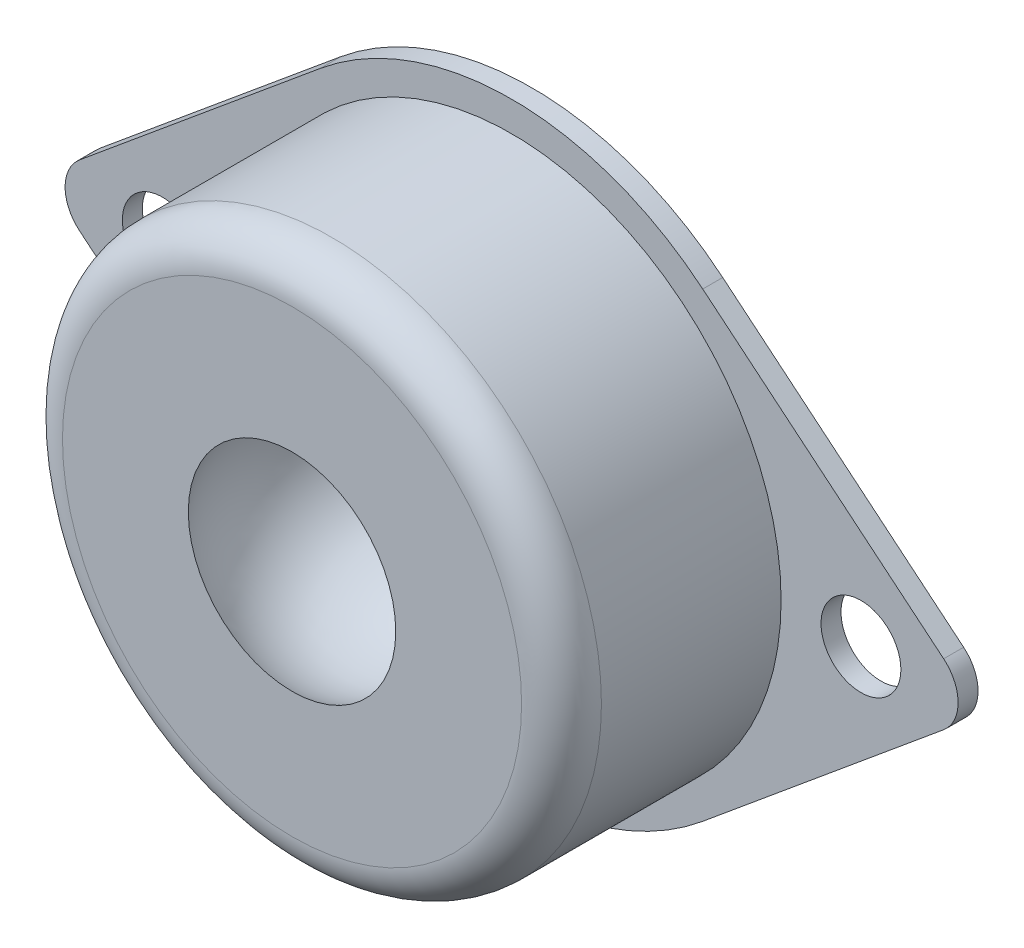
ISO-10303-21;
HEADER;
FILE_DESCRIPTION(('STEP AP214'),'2;1');
FILE_NAME('part.step','',(''),(''),'','','');
FILE_SCHEMA(('AUTOMOTIVE_DESIGN { 1 0 10303 214 1 1 1 1 }'));
ENDSEC;
DATA;
#1=APPLICATION_CONTEXT('core data for automotive mechanical design processes');
#2=APPLICATION_PROTOCOL_DEFINITION('international standard','automotive_design',2000,#1);
#3=PRODUCT_CONTEXT('',#1,'mechanical');
#4=PRODUCT('Part','Part','',(#3));
#5=PRODUCT_RELATED_PRODUCT_CATEGORY('part','',(#4));
#6=PRODUCT_DEFINITION_FORMATION('','',#4);
#7=PRODUCT_DEFINITION_CONTEXT('part definition',#1,'design');
#8=PRODUCT_DEFINITION('design','',#6,#7);
#9=PRODUCT_DEFINITION_SHAPE('','',#8);
#10=(LENGTH_UNIT() NAMED_UNIT(*) SI_UNIT(.MILLI.,.METRE.));
#11=(NAMED_UNIT(*) PLANE_ANGLE_UNIT() SI_UNIT($,.RADIAN.));
#12=(NAMED_UNIT(*) SI_UNIT($,.STERADIAN.) SOLID_ANGLE_UNIT());
#13=UNCERTAINTY_MEASURE_WITH_UNIT(LENGTH_MEASURE(1.E-05),#10,'distance_accuracy_value','');
#14=(GEOMETRIC_REPRESENTATION_CONTEXT(3) GLOBAL_UNCERTAINTY_ASSIGNED_CONTEXT((#13)) GLOBAL_UNIT_ASSIGNED_CONTEXT((#10,
#11,#12)) REPRESENTATION_CONTEXT('',''));
#15=CARTESIAN_POINT('',(0.,0.,0.));
#16=DIRECTION('',(0.,0.,1.));
#17=DIRECTION('',(1.,0.,0.));
#18=AXIS2_PLACEMENT_3D('',#15,#16,#17);
#19=CARTESIAN_POINT('',(-9.57446808510638,-11.5468420309312,1.));
#20=DIRECTION('',(0.638297872340426,0.769789468728746,0.));
#21=DIRECTION('',(-0.769789468728746,0.638297872340426,0.));
#22=AXIS2_PLACEMENT_3D('',#19,#20,#21);
#23=PLANE('',#22);
#24=DIRECTION('',(0.769789468728747,-0.638297872340426,0.));
#25=VECTOR('',#24,1.);
#26=CARTESIAN_POINT('',(-9.57446808510638,-11.5468420309312,0.));
#27=LINE('',#26,#25);
#28=CARTESIAN_POINT('',(-21.6432624113475,-1.53957893745749,0.));
#29=VERTEX_POINT('',#28);
#30=CARTESIAN_POINT('',(-9.57446808510639,-11.5468420309312,0.));
#31=VERTEX_POINT('',#30);
#32=EDGE_CURVE('E145',#29,#31,#27,.T.);
#33=ORIENTED_EDGE('',*,*,#32,.T.);
#34=DIRECTION('',(0.,0.,-1.));
#35=VECTOR('',#34,1.);
#36=CARTESIAN_POINT('',(-9.57446808510639,-11.5468420309312,1.));
#37=LINE('',#36,#35);
#38=CARTESIAN_POINT('',(-9.57446808510639,-11.5468420309312,1.));
#39=VERTEX_POINT('',#38);
#40=EDGE_CURVE('E175',#39,#31,#37,.T.);
#41=ORIENTED_EDGE('',*,*,#40,.F.);
#42=DIRECTION('',(0.769789468728747,-0.638297872340426,0.));
#43=VECTOR('',#42,1.);
#44=CARTESIAN_POINT('',(-9.57446808510638,-11.5468420309312,1.));
#45=LINE('',#44,#43);
#46=CARTESIAN_POINT('',(-21.6432624113475,-1.53957893745749,1.));
#47=VERTEX_POINT('',#46);
#48=EDGE_CURVE('E228',#47,#39,#45,.T.);
#49=ORIENTED_EDGE('',*,*,#48,.F.);
#50=DIRECTION('',(0.,0.,-1.));
#51=VECTOR('',#50,1.);
#52=CARTESIAN_POINT('',(-21.6432624113475,-1.53957893745749,1.));
#53=LINE('',#52,#51);
#54=EDGE_CURVE('E56',#47,#29,#53,.T.);
#55=ORIENTED_EDGE('',*,*,#54,.T.);
#56=EDGE_LOOP('',(#33,#41,#49,#55));
#57=FACE_BOUND('',#56,.T.);
#58=ADVANCED_FACE('F39',(#57),#23,.F.);
#59=CARTESIAN_POINT('',(0.,0.,1.));
#60=DIRECTION('',(0.,0.,-1.));
#61=DIRECTION('',(-1.,0.,0.));
#62=AXIS2_PLACEMENT_3D('',#59,#60,#61);
#63=CYLINDRICAL_SURFACE('',#62,15.);
#64=CARTESIAN_POINT('',(0.,0.,0.));
#65=DIRECTION('',(0.,0.,1.));
#66=DIRECTION('',(1.,0.,0.));
#67=AXIS2_PLACEMENT_3D('',#64,#65,#66);
#68=CIRCLE('',#67,15.);
#69=CARTESIAN_POINT('',(9.57446808510639,-11.5468420309312,0.));
#70=VERTEX_POINT('',#69);
#71=EDGE_CURVE('E147',#31,#70,#68,.T.);
#72=ORIENTED_EDGE('',*,*,#71,.T.);
#73=DIRECTION('',(0.,0.,-1.));
#74=VECTOR('',#73,1.);
#75=CARTESIAN_POINT('',(9.57446808510639,-11.5468420309312,1.));
#76=LINE('',#75,#74);
#77=CARTESIAN_POINT('',(9.57446808510639,-11.5468420309312,1.));
#78=VERTEX_POINT('',#77);
#79=EDGE_CURVE('E173',#78,#70,#76,.T.);
#80=ORIENTED_EDGE('',*,*,#79,.F.);
#81=CARTESIAN_POINT('',(0.,0.,1.));
#82=DIRECTION('',(0.,0.,1.));
#83=DIRECTION('',(1.,0.,0.));
#84=AXIS2_PLACEMENT_3D('',#81,#82,#83);
#85=CIRCLE('',#84,15.);
#86=EDGE_CURVE('E95',#39,#78,#85,.T.);
#87=ORIENTED_EDGE('',*,*,#86,.F.);
#88=ORIENTED_EDGE('',*,*,#40,.T.);
#89=EDGE_LOOP('',(#72,#80,#87,#88));
#90=FACE_BOUND('',#89,.T.);
#91=ADVANCED_FACE('F195',(#90),#63,.T.);
#92=CARTESIAN_POINT('',(9.57446808510639,-11.5468420309312,1.));
#93=DIRECTION('',(0.638297872340426,-0.769789468728746,0.));
#94=DIRECTION('',(0.769789468728746,0.638297872340426,0.));
#95=AXIS2_PLACEMENT_3D('',#92,#93,#94);
#96=PLANE('',#95);
#97=DIRECTION('',(-0.769789468728746,-0.638297872340426,0.));
#98=VECTOR('',#97,1.);
#99=CARTESIAN_POINT('',(9.57446808510639,-11.5468420309312,0.));
#100=LINE('',#99,#98);
#101=CARTESIAN_POINT('',(21.6432624113475,-1.53957893745749,0.));
#102=VERTEX_POINT('',#101);
#103=EDGE_CURVE('E150',#102,#70,#100,.T.);
#104=ORIENTED_EDGE('',*,*,#103,.F.);
#105=DIRECTION('',(0.,0.,-1.));
#106=VECTOR('',#105,1.);
#107=CARTESIAN_POINT('',(21.6432624113475,-1.53957893745749,1.));
#108=LINE('',#107,#106);
#109=CARTESIAN_POINT('',(21.6432624113475,-1.53957893745749,1.));
#110=VERTEX_POINT('',#109);
#111=EDGE_CURVE('E171',#110,#102,#108,.T.);
#112=ORIENTED_EDGE('',*,*,#111,.F.);
#113=DIRECTION('',(-0.769789468728746,-0.638297872340426,0.));
#114=VECTOR('',#113,1.);
#115=CARTESIAN_POINT('',(9.57446808510639,-11.5468420309312,1.));
#116=LINE('',#115,#114);
#117=EDGE_CURVE('E235',#110,#78,#116,.T.);
#118=ORIENTED_EDGE('',*,*,#117,.T.);
#119=ORIENTED_EDGE('',*,*,#79,.T.);
#120=EDGE_LOOP('',(#104,#112,#118,#119));
#121=FACE_BOUND('',#120,.T.);
#122=ADVANCED_FACE('F200',(#121),#96,.T.);
#123=CARTESIAN_POINT('',(20.3666666666667,0.,1.));
#124=DIRECTION('',(0.,0.,-1.));
#125=DIRECTION('',(-1.,0.,0.));
#126=AXIS2_PLACEMENT_3D('',#123,#124,#125);
#127=CYLINDRICAL_SURFACE('',#126,2.);
#128=CARTESIAN_POINT('',(20.3666666666667,0.,0.));
#129=DIRECTION('',(0.,0.,1.));
#130=DIRECTION('',(1.,0.,0.));
#131=AXIS2_PLACEMENT_3D('',#128,#129,#130);
#132=CIRCLE('',#131,2.);
#133=CARTESIAN_POINT('',(21.6432624113475,1.53957893745749,0.));
#134=VERTEX_POINT('',#133);
#135=EDGE_CURVE('E153',#134,#102,#132,.F.);
#136=ORIENTED_EDGE('',*,*,#135,.F.);
#137=DIRECTION('',(0.,0.,-1.));
#138=VECTOR('',#137,1.);
#139=CARTESIAN_POINT('',(21.6432624113475,1.53957893745749,1.));
#140=LINE('',#139,#138);
#141=CARTESIAN_POINT('',(21.6432624113475,1.53957893745749,1.));
#142=VERTEX_POINT('',#141);
#143=EDGE_CURVE('E169',#142,#134,#140,.T.);
#144=ORIENTED_EDGE('',*,*,#143,.F.);
#145=CARTESIAN_POINT('',(20.3666666666667,0.,1.));
#146=DIRECTION('',(0.,0.,1.));
#147=DIRECTION('',(1.,0.,0.));
#148=AXIS2_PLACEMENT_3D('',#145,#146,#147);
#149=CIRCLE('',#148,2.);
#150=EDGE_CURVE('E237',#142,#110,#149,.F.);
#151=ORIENTED_EDGE('',*,*,#150,.T.);
#152=ORIENTED_EDGE('',*,*,#111,.T.);
#153=EDGE_LOOP('',(#136,#144,#151,#152));
#154=FACE_BOUND('',#153,.T.);
#155=ADVANCED_FACE('F271',(#154),#127,.T.);
#156=CARTESIAN_POINT('',(9.57446808510639,11.5468420309312,1.));
#157=DIRECTION('',(-0.638297872340426,-0.769789468728746,0.));
#158=DIRECTION('',(0.769789468728746,-0.638297872340426,0.));
#159=AXIS2_PLACEMENT_3D('',#156,#157,#158);
#160=PLANE('',#159);
#161=DIRECTION('',(-0.769789468728746,0.638297872340426,0.));
#162=VECTOR('',#161,1.);
#163=CARTESIAN_POINT('',(9.57446808510639,11.5468420309312,0.));
#164=LINE('',#163,#162);
#165=CARTESIAN_POINT('',(9.57446808510639,11.5468420309312,0.));
#166=VERTEX_POINT('',#165);
#167=EDGE_CURVE('E156',#134,#166,#164,.T.);
#168=ORIENTED_EDGE('',*,*,#167,.T.);
#169=DIRECTION('',(0.,0.,-1.));
#170=VECTOR('',#169,1.);
#171=CARTESIAN_POINT('',(9.57446808510639,11.5468420309312,1.));
#172=LINE('',#171,#170);
#173=CARTESIAN_POINT('',(9.57446808510639,11.5468420309312,1.));
#174=VERTEX_POINT('',#173);
#175=EDGE_CURVE('E120',#174,#166,#172,.T.);
#176=ORIENTED_EDGE('',*,*,#175,.F.);
#177=DIRECTION('',(-0.769789468728746,0.638297872340426,0.));
#178=VECTOR('',#177,1.);
#179=CARTESIAN_POINT('',(9.57446808510639,11.5468420309312,1.));
#180=LINE('',#179,#178);
#181=EDGE_CURVE('E129',#142,#174,#180,.T.);
#182=ORIENTED_EDGE('',*,*,#181,.F.);
#183=ORIENTED_EDGE('',*,*,#143,.T.);
#184=EDGE_LOOP('',(#168,#176,#182,#183));
#185=FACE_BOUND('',#184,.T.);
#186=ADVANCED_FACE('F268',(#185),#160,.F.);
#187=CARTESIAN_POINT('',(0.,0.,1.));
#188=DIRECTION('',(0.,0.,-1.));
#189=DIRECTION('',(-1.,0.,0.));
#190=AXIS2_PLACEMENT_3D('',#187,#188,#189);
#191=CYLINDRICAL_SURFACE('',#190,15.);
#192=CARTESIAN_POINT('',(0.,0.,0.));
#193=DIRECTION('',(0.,0.,1.));
#194=DIRECTION('',(1.,0.,0.));
#195=AXIS2_PLACEMENT_3D('',#192,#193,#194);
#196=CIRCLE('',#195,15.);
#197=CARTESIAN_POINT('',(-9.57446808510639,11.5468420309312,0.));
#198=VERTEX_POINT('',#197);
#199=EDGE_CURVE('E116',#198,#166,#196,.F.);
#200=ORIENTED_EDGE('',*,*,#199,.F.);
#201=DIRECTION('',(0.,0.,-1.));
#202=VECTOR('',#201,1.);
#203=CARTESIAN_POINT('',(-9.57446808510639,11.5468420309312,1.));
#204=LINE('',#203,#202);
#205=CARTESIAN_POINT('',(-9.57446808510639,11.5468420309312,1.));
#206=VERTEX_POINT('',#205);
#207=EDGE_CURVE('E111',#206,#198,#204,.T.);
#208=ORIENTED_EDGE('',*,*,#207,.F.);
#209=CARTESIAN_POINT('',(0.,0.,1.));
#210=DIRECTION('',(0.,0.,1.));
#211=DIRECTION('',(1.,0.,0.));
#212=AXIS2_PLACEMENT_3D('',#209,#210,#211);
#213=CIRCLE('',#212,15.);
#214=EDGE_CURVE('E114',#206,#174,#213,.F.);
#215=ORIENTED_EDGE('',*,*,#214,.T.);
#216=ORIENTED_EDGE('',*,*,#175,.T.);
#217=EDGE_LOOP('',(#200,#208,#215,#216));
#218=FACE_BOUND('',#217,.T.);
#219=ADVANCED_FACE('F113',(#218),#191,.T.);
#220=CARTESIAN_POINT('',(-9.57446808510638,11.5468420309312,1.));
#221=DIRECTION('',(-0.638297872340426,0.769789468728746,0.));
#222=DIRECTION('',(-0.769789468728746,-0.638297872340426,0.));
#223=AXIS2_PLACEMENT_3D('',#220,#221,#222);
#224=PLANE('',#223);
#225=DIRECTION('',(0.769789468728747,0.638297872340426,0.));
#226=VECTOR('',#225,1.);
#227=CARTESIAN_POINT('',(-9.57446808510638,11.5468420309312,0.));
#228=LINE('',#227,#226);
#229=CARTESIAN_POINT('',(-21.6432624113475,1.53957893745749,0.));
#230=VERTEX_POINT('',#229);
#231=EDGE_CURVE('E160',#230,#198,#228,.T.);
#232=ORIENTED_EDGE('',*,*,#231,.F.);
#233=DIRECTION('',(0.,0.,-1.));
#234=VECTOR('',#233,1.);
#235=CARTESIAN_POINT('',(-21.6432624113475,1.53957893745749,1.));
#236=LINE('',#235,#234);
#237=CARTESIAN_POINT('',(-21.6432624113475,1.53957893745749,1.));
#238=VERTEX_POINT('',#237);
#239=EDGE_CURVE('E82',#238,#230,#236,.T.);
#240=ORIENTED_EDGE('',*,*,#239,.F.);
#241=DIRECTION('',(0.769789468728747,0.638297872340426,0.));
#242=VECTOR('',#241,1.);
#243=CARTESIAN_POINT('',(-9.57446808510638,11.5468420309312,1.));
#244=LINE('',#243,#242);
#245=EDGE_CURVE('E126',#238,#206,#244,.T.);
#246=ORIENTED_EDGE('',*,*,#245,.T.);
#247=ORIENTED_EDGE('',*,*,#207,.T.);
#248=EDGE_LOOP('',(#232,#240,#246,#247));
#249=FACE_BOUND('',#248,.T.);
#250=ADVANCED_FACE('F132',(#249),#224,.T.);
#251=CARTESIAN_POINT('',(17.5,0.,1.));
#252=DIRECTION('',(0.,0.,-1.));
#253=DIRECTION('',(-1.,0.,0.));
#254=AXIS2_PLACEMENT_3D('',#251,#252,#253);
#255=CYLINDRICAL_SURFACE('',#254,2.);
#256=CARTESIAN_POINT('',(17.5,0.,1.));
#257=DIRECTION('',(0.,0.,1.));
#258=DIRECTION('',(1.,0.,0.));
#259=AXIS2_PLACEMENT_3D('',#256,#257,#258);
#260=CIRCLE('',#259,2.);
#261=CARTESIAN_POINT('',(19.5,0.,1.));
#262=VERTEX_POINT('',#261);
#263=EDGE_CURVE('E243',#262,#262,#260,.T.);
#264=ORIENTED_EDGE('',*,*,#263,.T.);
#265=EDGE_LOOP('',(#264));
#266=FACE_BOUND('',#265,.T.);
#267=CARTESIAN_POINT('',(17.5,0.,0.));
#268=DIRECTION('',(0.,0.,1.));
#269=DIRECTION('',(1.,0.,0.));
#270=AXIS2_PLACEMENT_3D('',#267,#268,#269);
#271=CIRCLE('',#270,2.);
#272=CARTESIAN_POINT('',(19.5,0.,0.));
#273=VERTEX_POINT('',#272);
#274=EDGE_CURVE('E141',#273,#273,#271,.T.);
#275=ORIENTED_EDGE('',*,*,#274,.F.);
#276=EDGE_LOOP('',(#275));
#277=FACE_BOUND('',#276,.T.);
#278=ADVANCED_FACE('F204',(#266,#277),#255,.F.);
#279=CARTESIAN_POINT('',(-17.5,0.,1.));
#280=DIRECTION('',(0.,0.,-1.));
#281=DIRECTION('',(-1.,0.,0.));
#282=AXIS2_PLACEMENT_3D('',#279,#280,#281);
#283=CYLINDRICAL_SURFACE('',#282,2.);
#284=CARTESIAN_POINT('',(-17.5,0.,1.));
#285=DIRECTION('',(0.,0.,1.));
#286=DIRECTION('',(1.,0.,0.));
#287=AXIS2_PLACEMENT_3D('',#284,#285,#286);
#288=CIRCLE('',#287,2.);
#289=CARTESIAN_POINT('',(-15.5,0.,1.));
#290=VERTEX_POINT('',#289);
#291=EDGE_CURVE('E218',#290,#290,#288,.T.);
#292=ORIENTED_EDGE('',*,*,#291,.T.);
#293=EDGE_LOOP('',(#292));
#294=FACE_BOUND('',#293,.T.);
#295=CARTESIAN_POINT('',(-17.5,0.,0.));
#296=DIRECTION('',(0.,0.,1.));
#297=DIRECTION('',(1.,0.,0.));
#298=AXIS2_PLACEMENT_3D('',#295,#296,#297);
#299=CIRCLE('',#298,2.);
#300=CARTESIAN_POINT('',(-15.5,0.,0.));
#301=VERTEX_POINT('',#300);
#302=EDGE_CURVE('E138',#301,#301,#299,.T.);
#303=ORIENTED_EDGE('',*,*,#302,.F.);
#304=EDGE_LOOP('',(#303));
#305=FACE_BOUND('',#304,.T.);
#306=ADVANCED_FACE('F206',(#294,#305),#283,.F.);
#307=CARTESIAN_POINT('',(-20.3666666666667,0.,1.));
#308=DIRECTION('',(0.,0.,-1.));
#309=DIRECTION('',(-1.,0.,0.));
#310=AXIS2_PLACEMENT_3D('',#307,#308,#309);
#311=CYLINDRICAL_SURFACE('',#310,2.);
#312=CARTESIAN_POINT('',(-20.3666666666667,0.,0.));
#313=DIRECTION('',(0.,0.,1.));
#314=DIRECTION('',(1.,0.,0.));
#315=AXIS2_PLACEMENT_3D('',#312,#313,#314);
#316=CIRCLE('',#315,2.);
#317=EDGE_CURVE('E162',#29,#230,#316,.F.);
#318=ORIENTED_EDGE('',*,*,#317,.F.);
#319=ORIENTED_EDGE('',*,*,#54,.F.);
#320=CARTESIAN_POINT('',(-20.3666666666667,0.,1.));
#321=DIRECTION('',(0.,0.,1.));
#322=DIRECTION('',(1.,0.,0.));
#323=AXIS2_PLACEMENT_3D('',#320,#321,#322);
#324=CIRCLE('',#323,2.);
#325=EDGE_CURVE('E133',#47,#238,#324,.F.);
#326=ORIENTED_EDGE('',*,*,#325,.T.);
#327=ORIENTED_EDGE('',*,*,#239,.T.);
#328=EDGE_LOOP('',(#318,#319,#326,#327));
#329=FACE_BOUND('',#328,.T.);
#330=ADVANCED_FACE('F209',(#329),#311,.T.);
#331=CARTESIAN_POINT('',(0.,0.,1.));
#332=DIRECTION('',(0.,0.,1.));
#333=DIRECTION('',(1.,0.,0.));
#334=AXIS2_PLACEMENT_3D('',#331,#332,#333);
#335=PLANE('',#334);
#336=CARTESIAN_POINT('',(0.,0.,1.));
#337=DIRECTION('',(0.,0.,1.));
#338=DIRECTION('',(1.,0.,0.));
#339=AXIS2_PLACEMENT_3D('',#336,#337,#338);
#340=CIRCLE('',#339,13.5);
#341=CARTESIAN_POINT('',(13.5,0.,1.));
#342=VERTEX_POINT('',#341);
#343=EDGE_CURVE('E165',#342,#342,#340,.T.);
#344=ORIENTED_EDGE('',*,*,#343,.F.);
#345=EDGE_LOOP('',(#344));
#346=FACE_BOUND('',#345,.T.);
#347=ORIENTED_EDGE('',*,*,#291,.F.);
#348=EDGE_LOOP('',(#347));
#349=FACE_BOUND('',#348,.T.);
#350=ORIENTED_EDGE('',*,*,#263,.F.);
#351=EDGE_LOOP('',(#350));
#352=FACE_BOUND('',#351,.T.);
#353=ORIENTED_EDGE('',*,*,#48,.T.);
#354=ORIENTED_EDGE('',*,*,#86,.T.);
#355=ORIENTED_EDGE('',*,*,#117,.F.);
#356=ORIENTED_EDGE('',*,*,#150,.F.);
#357=ORIENTED_EDGE('',*,*,#181,.T.);
#358=ORIENTED_EDGE('',*,*,#214,.F.);
#359=ORIENTED_EDGE('',*,*,#245,.F.);
#360=ORIENTED_EDGE('',*,*,#325,.F.);
#361=EDGE_LOOP('',(#353,#354,#355,#356,#357,#358,#359,#360));
#362=FACE_BOUND('',#361,.T.);
#363=ADVANCED_FACE('F124',(#346,#349,#352,#362),#335,.T.);
#364=CARTESIAN_POINT('',(0.,0.,0.));
#365=DIRECTION('',(0.,0.,1.));
#366=DIRECTION('',(1.,0.,0.));
#367=AXIS2_PLACEMENT_3D('',#364,#365,#366);
#368=PLANE('',#367);
#369=ORIENTED_EDGE('',*,*,#302,.T.);
#370=EDGE_LOOP('',(#369));
#371=FACE_BOUND('',#370,.T.);
#372=ORIENTED_EDGE('',*,*,#274,.T.);
#373=EDGE_LOOP('',(#372));
#374=FACE_BOUND('',#373,.T.);
#375=ORIENTED_EDGE('',*,*,#32,.F.);
#376=ORIENTED_EDGE('',*,*,#317,.T.);
#377=ORIENTED_EDGE('',*,*,#231,.T.);
#378=ORIENTED_EDGE('',*,*,#199,.T.);
#379=ORIENTED_EDGE('',*,*,#167,.F.);
#380=ORIENTED_EDGE('',*,*,#135,.T.);
#381=ORIENTED_EDGE('',*,*,#103,.T.);
#382=ORIENTED_EDGE('',*,*,#71,.F.);
#383=EDGE_LOOP('',(#375,#376,#377,#378,#379,#380,#381,#382));
#384=FACE_BOUND('',#383,.T.);
#385=ADVANCED_FACE('F221',(#371,#374,#384),#368,.F.);
#386=CARTESIAN_POINT('',(0.,0.,12.));
#387=DIRECTION('',(0.,0.,-1.));
#388=DIRECTION('',(-1.,0.,0.));
#389=AXIS2_PLACEMENT_3D('',#386,#387,#388);
#390=CYLINDRICAL_SURFACE('',#389,13.5);
#391=CARTESIAN_POINT('',(0.,0.,10.));
#392=DIRECTION('',(0.,0.,1.));
#393=DIRECTION('',(1.,0.,0.));
#394=AXIS2_PLACEMENT_3D('',#391,#392,#393);
#395=CIRCLE('',#394,13.5);
#396=CARTESIAN_POINT('',(13.5,0.,10.));
#397=VERTEX_POINT('',#396);
#398=EDGE_CURVE('E11',#397,#397,#395,.F.);
#399=ORIENTED_EDGE('',*,*,#398,.T.);
#400=EDGE_LOOP('',(#399));
#401=FACE_BOUND('',#400,.T.);
#402=ORIENTED_EDGE('',*,*,#343,.T.);
#403=EDGE_LOOP('',(#402));
#404=FACE_BOUND('',#403,.T.);
#405=ADVANCED_FACE('F190',(#401,#404),#390,.T.);
#406=CARTESIAN_POINT('',(0.,0.,12.));
#407=DIRECTION('',(0.,0.,1.));
#408=DIRECTION('',(1.,0.,0.));
#409=AXIS2_PLACEMENT_3D('',#406,#407,#408);
#410=PLANE('',#409);
#411=CARTESIAN_POINT('',(0.,0.,12.));
#412=DIRECTION('',(0.,0.,-1.));
#413=DIRECTION('',(-1.,0.,0.));
#414=AXIS2_PLACEMENT_3D('',#411,#412,#413);
#415=CIRCLE('',#414,5.19615242270663);
#416=CARTESIAN_POINT('',(-5.19615242270663,0.,12.));
#417=VERTEX_POINT('',#416);
#418=EDGE_CURVE('E142',#417,#417,#415,.T.);
#419=ORIENTED_EDGE('',*,*,#418,.T.);
#420=EDGE_LOOP('',(#419));
#421=FACE_BOUND('',#420,.T.);
#422=CARTESIAN_POINT('',(0.,0.,12.));
#423=DIRECTION('',(0.,0.,1.));
#424=DIRECTION('',(1.,0.,0.));
#425=AXIS2_PLACEMENT_3D('',#422,#423,#424);
#426=CIRCLE('',#425,11.5);
#427=CARTESIAN_POINT('',(11.5,0.,12.));
#428=VERTEX_POINT('',#427);
#429=EDGE_CURVE('E48',#428,#428,#426,.T.);
#430=ORIENTED_EDGE('',*,*,#429,.T.);
#431=EDGE_LOOP('',(#430));
#432=FACE_BOUND('',#431,.T.);
#433=ADVANCED_FACE('F179',(#421,#432),#410,.T.);
#434=CARTESIAN_POINT('',(0.,0.,10.));
#435=DIRECTION('',(0.,0.,1.));
#436=DIRECTION('',(1.,0.,0.));
#437=AXIS2_PLACEMENT_3D('',#434,#435,#436);
#438=TOROIDAL_SURFACE('',#437,11.5,2.);
#439=ORIENTED_EDGE('',*,*,#398,.F.);
#440=EDGE_LOOP('',(#439));
#441=FACE_BOUND('',#440,.T.);
#442=ORIENTED_EDGE('',*,*,#429,.F.);
#443=EDGE_LOOP('',(#442));
#444=FACE_BOUND('',#443,.T.);
#445=ADVANCED_FACE('F41',(#441,#444),#438,.T.);
#446=CARTESIAN_POINT('',(0.,0.,9.));
#447=DIRECTION('',(0.,0.,-1.));
#448=DIRECTION('',(1.,0.,0.));
#449=AXIS2_PLACEMENT_3D('',#446,#447,#448);
#450=SPHERICAL_SURFACE('',#449,6.00000000000001);
#451=ORIENTED_EDGE('',*,*,#418,.F.);
#452=EDGE_LOOP('',(#451));
#453=FACE_BOUND('',#452,.T.);
#454=ADVANCED_FACE('F182',(#453),#450,.F.);
#455=CLOSED_SHELL('',(#58,#91,#122,#155,#186,#219,#250,#278,#306,#330,#363,#385,#405,#433,#445,#454));
#456=MANIFOLD_SOLID_BREP('B2',#455);
#457=ADVANCED_BREP_SHAPE_REPRESENTATION('',(#18,#456),#14);
#458=SHAPE_DEFINITION_REPRESENTATION(#9,#457);
ENDSEC;
END-ISO-10303-21;
